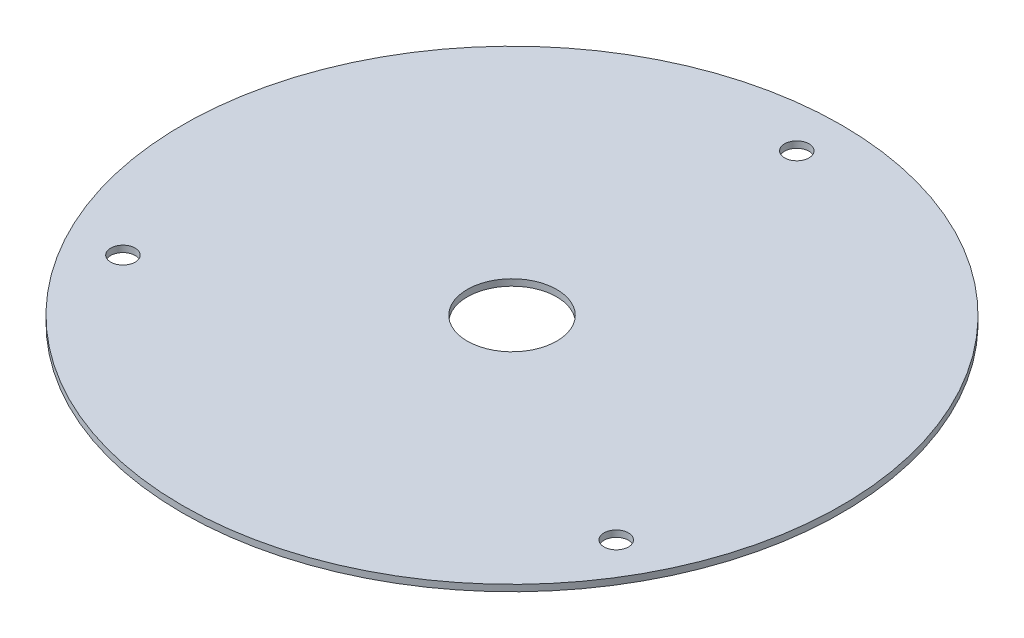
ISO-10303-21;
HEADER;
FILE_DESCRIPTION(('STEP AP214'),'2;1');
FILE_NAME('part.step','',(''),(''),'','','');
FILE_SCHEMA(('AUTOMOTIVE_DESIGN { 1 0 10303 214 1 1 1 1 }'));
ENDSEC;
DATA;
#1=APPLICATION_CONTEXT('core data for automotive mechanical design processes');
#2=APPLICATION_PROTOCOL_DEFINITION('international standard','automotive_design',2000,#1);
#3=PRODUCT_CONTEXT('',#1,'mechanical');
#4=PRODUCT('Part','Part','',(#3));
#5=PRODUCT_RELATED_PRODUCT_CATEGORY('part','',(#4));
#6=PRODUCT_DEFINITION_FORMATION('','',#4);
#7=PRODUCT_DEFINITION_CONTEXT('part definition',#1,'design');
#8=PRODUCT_DEFINITION('design','',#6,#7);
#9=PRODUCT_DEFINITION_SHAPE('','',#8);
#10=(LENGTH_UNIT() NAMED_UNIT(*) SI_UNIT(.MILLI.,.METRE.));
#11=(NAMED_UNIT(*) PLANE_ANGLE_UNIT() SI_UNIT($,.RADIAN.));
#12=(NAMED_UNIT(*) SI_UNIT($,.STERADIAN.) SOLID_ANGLE_UNIT());
#13=UNCERTAINTY_MEASURE_WITH_UNIT(LENGTH_MEASURE(1.E-05),#10,'distance_accuracy_value','');
#14=(GEOMETRIC_REPRESENTATION_CONTEXT(3) GLOBAL_UNCERTAINTY_ASSIGNED_CONTEXT((#13)) GLOBAL_UNIT_ASSIGNED_CONTEXT((#10,
#11,#12)) REPRESENTATION_CONTEXT('',''));
#15=CARTESIAN_POINT('',(0.,0.,0.));
#16=DIRECTION('',(0.,0.,1.));
#17=DIRECTION('',(1.,0.,0.));
#18=AXIS2_PLACEMENT_3D('',#15,#16,#17);
#19=CARTESIAN_POINT('',(0.,1.5875,0.));
#20=DIRECTION('',(0.,1.,0.));
#21=DIRECTION('',(0.,0.,1.));
#22=AXIS2_PLACEMENT_3D('',#19,#20,#21);
#23=PLANE('',#22);
#24=CARTESIAN_POINT('',(60.6217782649152,1.5875,34.9999999999974));
#25=DIRECTION('',(0.,1.,0.));
#26=DIRECTION('',(0.,0.,1.));
#27=AXIS2_PLACEMENT_3D('',#24,#25,#26);
#28=CIRCLE('',#27,3.00000000000384);
#29=CARTESIAN_POINT('',(60.6217782649152,1.5875,38.0000000000013));
#30=VERTEX_POINT('',#29);
#31=EDGE_CURVE('E53',#30,#30,#28,.T.);
#32=ORIENTED_EDGE('',*,*,#31,.F.);
#33=EDGE_LOOP('',(#32));
#34=FACE_BOUND('',#33,.T.);
#35=CARTESIAN_POINT('',(0.,1.5875,0.));
#36=DIRECTION('',(0.,1.,0.));
#37=DIRECTION('',(0.,0.,1.));
#38=AXIS2_PLACEMENT_3D('',#35,#36,#37);
#39=CIRCLE('',#38,11.);
#40=CARTESIAN_POINT('',(0.,1.5875,11.));
#41=VERTEX_POINT('',#40);
#42=EDGE_CURVE('E42',#41,#41,#39,.T.);
#43=ORIENTED_EDGE('',*,*,#42,.F.);
#44=EDGE_LOOP('',(#43));
#45=FACE_BOUND('',#44,.T.);
#46=CARTESIAN_POINT('',(0.,1.5875,0.));
#47=DIRECTION('',(0.,1.,0.));
#48=DIRECTION('',(0.,0.,1.));
#49=AXIS2_PLACEMENT_3D('',#46,#47,#48);
#50=CIRCLE('',#49,81.);
#51=CARTESIAN_POINT('',(0.,1.5875,81.));
#52=VERTEX_POINT('',#51);
#53=EDGE_CURVE('E10',#52,#52,#50,.T.);
#54=ORIENTED_EDGE('',*,*,#53,.T.);
#55=EDGE_LOOP('',(#54));
#56=FACE_BOUND('',#55,.T.);
#57=CARTESIAN_POINT('',(0.,1.5875,-70.));
#58=DIRECTION('',(0.,1.,0.));
#59=DIRECTION('',(0.,0.,1.));
#60=AXIS2_PLACEMENT_3D('',#57,#58,#59);
#61=CIRCLE('',#60,3.);
#62=CARTESIAN_POINT('',(0.,1.5875,-67.));
#63=VERTEX_POINT('',#62);
#64=EDGE_CURVE('E47',#63,#63,#61,.T.);
#65=ORIENTED_EDGE('',*,*,#64,.F.);
#66=EDGE_LOOP('',(#65));
#67=FACE_BOUND('',#66,.T.);
#68=CARTESIAN_POINT('',(-60.6217782649062,1.5875,35.0000000000026));
#69=DIRECTION('',(0.,1.,0.));
#70=DIRECTION('',(0.,0.,1.));
#71=AXIS2_PLACEMENT_3D('',#68,#69,#70);
#72=CIRCLE('',#71,3.00000000000566);
#73=CARTESIAN_POINT('',(-60.6217782649062,1.5875,38.0000000000083));
#74=VERTEX_POINT('',#73);
#75=EDGE_CURVE('E59',#74,#74,#72,.T.);
#76=ORIENTED_EDGE('',*,*,#75,.F.);
#77=EDGE_LOOP('',(#76));
#78=FACE_BOUND('',#77,.T.);
#79=ADVANCED_FACE('F31',(#34,#45,#56,#67,#78),#23,.T.);
#80=CARTESIAN_POINT('',(0.,0.,0.));
#81=DIRECTION('',(0.,1.,0.));
#82=DIRECTION('',(0.,0.,1.));
#83=AXIS2_PLACEMENT_3D('',#80,#81,#82);
#84=PLANE('',#83);
#85=CARTESIAN_POINT('',(0.,0.,0.));
#86=DIRECTION('',(0.,1.,0.));
#87=DIRECTION('',(0.,0.,1.));
#88=AXIS2_PLACEMENT_3D('',#85,#86,#87);
#89=CIRCLE('',#88,81.);
#90=CARTESIAN_POINT('',(0.,0.,81.));
#91=VERTEX_POINT('',#90);
#92=EDGE_CURVE('E35',#91,#91,#89,.T.);
#93=ORIENTED_EDGE('',*,*,#92,.F.);
#94=EDGE_LOOP('',(#93));
#95=FACE_BOUND('',#94,.T.);
#96=CARTESIAN_POINT('',(0.,0.,0.));
#97=DIRECTION('',(0.,1.,0.));
#98=DIRECTION('',(0.,0.,1.));
#99=AXIS2_PLACEMENT_3D('',#96,#97,#98);
#100=CIRCLE('',#99,11.);
#101=CARTESIAN_POINT('',(0.,0.,11.));
#102=VERTEX_POINT('',#101);
#103=EDGE_CURVE('E44',#102,#102,#100,.T.);
#104=ORIENTED_EDGE('',*,*,#103,.T.);
#105=EDGE_LOOP('',(#104));
#106=FACE_BOUND('',#105,.T.);
#107=CARTESIAN_POINT('',(0.,0.,-70.));
#108=DIRECTION('',(0.,1.,0.));
#109=DIRECTION('',(0.,0.,1.));
#110=AXIS2_PLACEMENT_3D('',#107,#108,#109);
#111=CIRCLE('',#110,3.);
#112=CARTESIAN_POINT('',(0.,0.,-67.));
#113=VERTEX_POINT('',#112);
#114=EDGE_CURVE('E50',#113,#113,#111,.T.);
#115=ORIENTED_EDGE('',*,*,#114,.T.);
#116=EDGE_LOOP('',(#115));
#117=FACE_BOUND('',#116,.T.);
#118=CARTESIAN_POINT('',(60.6217782649152,0.,34.9999999999974));
#119=DIRECTION('',(0.,1.,0.));
#120=DIRECTION('',(0.,0.,1.));
#121=AXIS2_PLACEMENT_3D('',#118,#119,#120);
#122=CIRCLE('',#121,3.00000000000384);
#123=CARTESIAN_POINT('',(60.6217782649152,0.,38.0000000000013));
#124=VERTEX_POINT('',#123);
#125=EDGE_CURVE('E56',#124,#124,#122,.T.);
#126=ORIENTED_EDGE('',*,*,#125,.T.);
#127=EDGE_LOOP('',(#126));
#128=FACE_BOUND('',#127,.T.);
#129=CARTESIAN_POINT('',(-60.6217782649062,0.,35.0000000000026));
#130=DIRECTION('',(0.,1.,0.));
#131=DIRECTION('',(0.,0.,1.));
#132=AXIS2_PLACEMENT_3D('',#129,#130,#131);
#133=CIRCLE('',#132,3.00000000000566);
#134=CARTESIAN_POINT('',(-60.6217782649062,0.,38.0000000000083));
#135=VERTEX_POINT('',#134);
#136=EDGE_CURVE('E62',#135,#135,#133,.T.);
#137=ORIENTED_EDGE('',*,*,#136,.T.);
#138=EDGE_LOOP('',(#137));
#139=FACE_BOUND('',#138,.T.);
#140=ADVANCED_FACE('F72',(#95,#106,#117,#128,#139),#84,.F.);
#141=CARTESIAN_POINT('',(0.,1.5875,0.));
#142=DIRECTION('',(0.,-1.,0.));
#143=DIRECTION('',(0.,0.,-1.));
#144=AXIS2_PLACEMENT_3D('',#141,#142,#143);
#145=CYLINDRICAL_SURFACE('',#144,81.);
#146=ORIENTED_EDGE('',*,*,#53,.F.);
#147=EDGE_LOOP('',(#146));
#148=FACE_BOUND('',#147,.T.);
#149=ORIENTED_EDGE('',*,*,#92,.T.);
#150=EDGE_LOOP('',(#149));
#151=FACE_BOUND('',#150,.T.);
#152=ADVANCED_FACE('F33',(#148,#151),#145,.T.);
#153=CARTESIAN_POINT('',(0.,1.5875,0.));
#154=DIRECTION('',(0.,-1.,0.));
#155=DIRECTION('',(0.,0.,-1.));
#156=AXIS2_PLACEMENT_3D('',#153,#154,#155);
#157=CYLINDRICAL_SURFACE('',#156,11.);
#158=ORIENTED_EDGE('',*,*,#42,.T.);
#159=EDGE_LOOP('',(#158));
#160=FACE_BOUND('',#159,.T.);
#161=ORIENTED_EDGE('',*,*,#103,.F.);
#162=EDGE_LOOP('',(#161));
#163=FACE_BOUND('',#162,.T.);
#164=ADVANCED_FACE('F82',(#160,#163),#157,.F.);
#165=CARTESIAN_POINT('',(0.,1.5875,-70.));
#166=DIRECTION('',(0.,-1.,0.));
#167=DIRECTION('',(0.,0.,-1.));
#168=AXIS2_PLACEMENT_3D('',#165,#166,#167);
#169=CYLINDRICAL_SURFACE('',#168,3.);
#170=ORIENTED_EDGE('',*,*,#64,.T.);
#171=EDGE_LOOP('',(#170));
#172=FACE_BOUND('',#171,.T.);
#173=ORIENTED_EDGE('',*,*,#114,.F.);
#174=EDGE_LOOP('',(#173));
#175=FACE_BOUND('',#174,.T.);
#176=ADVANCED_FACE('F85',(#172,#175),#169,.F.);
#177=CARTESIAN_POINT('',(60.6217782649152,1.5875,34.9999999999974));
#178=DIRECTION('',(0.,-1.,0.));
#179=DIRECTION('',(0.,0.,-1.));
#180=AXIS2_PLACEMENT_3D('',#177,#178,#179);
#181=CYLINDRICAL_SURFACE('',#180,3.00000000000384);
#182=ORIENTED_EDGE('',*,*,#31,.T.);
#183=EDGE_LOOP('',(#182));
#184=FACE_BOUND('',#183,.T.);
#185=ORIENTED_EDGE('',*,*,#125,.F.);
#186=EDGE_LOOP('',(#185));
#187=FACE_BOUND('',#186,.T.);
#188=ADVANCED_FACE('F89',(#184,#187),#181,.F.);
#189=CARTESIAN_POINT('',(-60.6217782649062,1.5875,35.0000000000026));
#190=DIRECTION('',(0.,-1.,0.));
#191=DIRECTION('',(0.,0.,-1.));
#192=AXIS2_PLACEMENT_3D('',#189,#190,#191);
#193=CYLINDRICAL_SURFACE('',#192,3.00000000000566);
#194=ORIENTED_EDGE('',*,*,#75,.T.);
#195=EDGE_LOOP('',(#194));
#196=FACE_BOUND('',#195,.T.);
#197=ORIENTED_EDGE('',*,*,#136,.F.);
#198=EDGE_LOOP('',(#197));
#199=FACE_BOUND('',#198,.T.);
#200=ADVANCED_FACE('F68',(#196,#199),#193,.F.);
#201=CLOSED_SHELL('',(#79,#140,#152,#164,#176,#188,#200));
#202=MANIFOLD_SOLID_BREP('B2',#201);
#203=ADVANCED_BREP_SHAPE_REPRESENTATION('',(#18,#202),#14);
#204=SHAPE_DEFINITION_REPRESENTATION(#9,#203);
ENDSEC;
END-ISO-10303-21;
